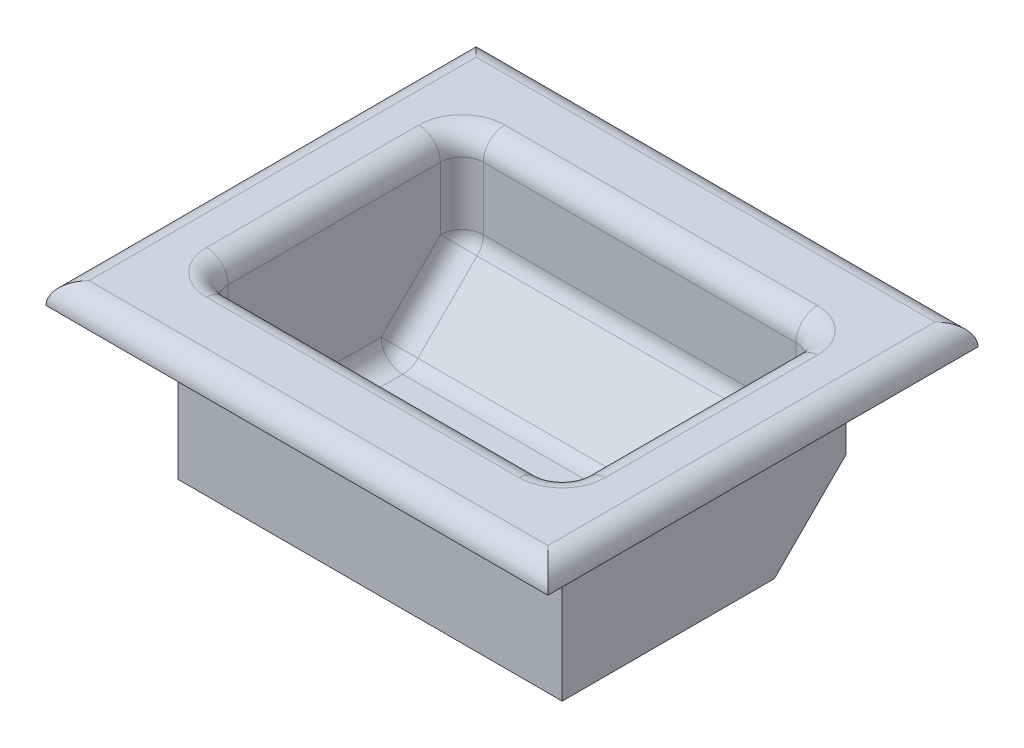
ISO-10303-21;
HEADER;
FILE_DESCRIPTION(('STEP AP214'),'2;1');
FILE_NAME('part.step','',(''),(''),'','','');
FILE_SCHEMA(('AUTOMOTIVE_DESIGN { 1 0 10303 214 1 1 1 1 }'));
ENDSEC;
DATA;
#1=APPLICATION_CONTEXT('core data for automotive mechanical design processes');
#2=APPLICATION_PROTOCOL_DEFINITION('international standard','automotive_design',2000,#1);
#3=PRODUCT_CONTEXT('',#1,'mechanical');
#4=PRODUCT('Part','Part','',(#3));
#5=PRODUCT_RELATED_PRODUCT_CATEGORY('part','',(#4));
#6=PRODUCT_DEFINITION_FORMATION('','',#4);
#7=PRODUCT_DEFINITION_CONTEXT('part definition',#1,'design');
#8=PRODUCT_DEFINITION('design','',#6,#7);
#9=PRODUCT_DEFINITION_SHAPE('','',#8);
#10=(LENGTH_UNIT() NAMED_UNIT(*) SI_UNIT(.MILLI.,.METRE.));
#11=(NAMED_UNIT(*) PLANE_ANGLE_UNIT() SI_UNIT($,.RADIAN.));
#12=(NAMED_UNIT(*) SI_UNIT($,.STERADIAN.) SOLID_ANGLE_UNIT());
#13=UNCERTAINTY_MEASURE_WITH_UNIT(LENGTH_MEASURE(1.E-05),#10,'distance_accuracy_value','');
#14=(GEOMETRIC_REPRESENTATION_CONTEXT(3) GLOBAL_UNCERTAINTY_ASSIGNED_CONTEXT((#13)) GLOBAL_UNIT_ASSIGNED_CONTEXT((#10,
#11,#12)) REPRESENTATION_CONTEXT('',''));
#15=CARTESIAN_POINT('',(0.,0.,0.));
#16=DIRECTION('',(0.,0.,1.));
#17=DIRECTION('',(1.,0.,0.));
#18=AXIS2_PLACEMENT_3D('',#15,#16,#17);
#19=CARTESIAN_POINT('',(-26.8,2.,19.8));
#20=DIRECTION('',(1.,0.,0.));
#21=DIRECTION('',(0.,0.,-1.));
#22=AXIS2_PLACEMENT_3D('',#19,#20,#21);
#23=PLANE('',#22);
#24=DIRECTION('',(0.,-1.,0.));
#25=VECTOR('',#24,1.);
#26=CARTESIAN_POINT('',(-26.8,2.,-19.8));
#27=LINE('',#26,#25);
#28=CARTESIAN_POINT('',(-26.8,22.,-19.8));
#29=VERTEX_POINT('',#28);
#30=CARTESIAN_POINT('',(-26.8,9.99999999999999,-19.8));
#31=VERTEX_POINT('',#30);
#32=EDGE_CURVE('E259',#29,#31,#27,.T.);
#33=ORIENTED_EDGE('',*,*,#32,.T.);
#34=DIRECTION('',(0.,0.707106781186546,-0.707106781186549));
#35=VECTOR('',#34,1.);
#36=CARTESIAN_POINT('',(-26.8,10.,-19.8));
#37=LINE('',#36,#35);
#38=CARTESIAN_POINT('',(-26.8,0.,-9.79999999999995));
#39=VERTEX_POINT('',#38);
#40=EDGE_CURVE('E274',#31,#39,#37,.F.);
#41=ORIENTED_EDGE('',*,*,#40,.T.);
#42=DIRECTION('',(0.,0.,1.));
#43=VECTOR('',#42,1.);
#44=CARTESIAN_POINT('',(-26.8,0.,19.8));
#45=LINE('',#44,#43);
#46=CARTESIAN_POINT('',(-26.8,0.,19.8));
#47=VERTEX_POINT('',#46);
#48=EDGE_CURVE('E252',#39,#47,#45,.T.);
#49=ORIENTED_EDGE('',*,*,#48,.T.);
#50=DIRECTION('',(0.,-1.,0.));
#51=VECTOR('',#50,1.);
#52=CARTESIAN_POINT('',(-26.8,2.,19.8));
#53=LINE('',#52,#51);
#54=CARTESIAN_POINT('',(-26.8,22.,19.8));
#55=VERTEX_POINT('',#54);
#56=EDGE_CURVE('E268',#55,#47,#53,.T.);
#57=ORIENTED_EDGE('',*,*,#56,.F.);
#58=DIRECTION('',(0.,0.,1.));
#59=VECTOR('',#58,1.);
#60=CARTESIAN_POINT('',(-26.8,22.,19.8));
#61=LINE('',#60,#59);
#62=EDGE_CURVE('E240',#29,#55,#61,.T.);
#63=ORIENTED_EDGE('',*,*,#62,.F.);
#64=EDGE_LOOP('',(#33,#41,#49,#57,#63));
#65=FACE_BOUND('',#64,.T.);
#66=ADVANCED_FACE('F34',(#65),#23,.F.);
#67=CARTESIAN_POINT('',(26.8,2.,19.8));
#68=DIRECTION('',(0.,0.,-1.));
#69=DIRECTION('',(-1.,0.,0.));
#70=AXIS2_PLACEMENT_3D('',#67,#68,#69);
#71=PLANE('',#70);
#72=DIRECTION('',(1.,0.,0.));
#73=VECTOR('',#72,1.);
#74=CARTESIAN_POINT('',(26.8,0.,19.8));
#75=LINE('',#74,#73);
#76=CARTESIAN_POINT('',(26.8,0.,19.8));
#77=VERTEX_POINT('',#76);
#78=EDGE_CURVE('E254',#47,#77,#75,.T.);
#79=ORIENTED_EDGE('',*,*,#78,.T.);
#80=DIRECTION('',(0.,-1.,0.));
#81=VECTOR('',#80,1.);
#82=CARTESIAN_POINT('',(26.8,2.,19.8));
#83=LINE('',#82,#81);
#84=CARTESIAN_POINT('',(26.8,22.,19.8));
#85=VERTEX_POINT('',#84);
#86=EDGE_CURVE('E265',#85,#77,#83,.T.);
#87=ORIENTED_EDGE('',*,*,#86,.F.);
#88=DIRECTION('',(1.,0.,0.));
#89=VECTOR('',#88,1.);
#90=CARTESIAN_POINT('',(26.8,22.,19.8));
#91=LINE('',#90,#89);
#92=EDGE_CURVE('E243',#55,#85,#91,.T.);
#93=ORIENTED_EDGE('',*,*,#92,.F.);
#94=ORIENTED_EDGE('',*,*,#56,.T.);
#95=EDGE_LOOP('',(#79,#87,#93,#94));
#96=FACE_BOUND('',#95,.T.);
#97=ADVANCED_FACE('F467',(#96),#71,.F.);
#98=CARTESIAN_POINT('',(26.8,2.,19.8));
#99=DIRECTION('',(-1.,0.,0.));
#100=DIRECTION('',(0.,0.,1.));
#101=AXIS2_PLACEMENT_3D('',#98,#99,#100);
#102=PLANE('',#101);
#103=DIRECTION('',(0.,0.,-1.));
#104=VECTOR('',#103,1.);
#105=CARTESIAN_POINT('',(26.8,0.,19.8));
#106=LINE('',#105,#104);
#107=CARTESIAN_POINT('',(26.8,0.,-9.79999999999995));
#108=VERTEX_POINT('',#107);
#109=EDGE_CURVE('E256',#77,#108,#106,.T.);
#110=ORIENTED_EDGE('',*,*,#109,.T.);
#111=DIRECTION('',(0.,-0.707106781186546,0.707106781186549));
#112=VECTOR('',#111,1.);
#113=CARTESIAN_POINT('',(26.8,9.99999999999999,-19.8));
#114=LINE('',#113,#112);
#115=CARTESIAN_POINT('',(26.8,9.99999999999999,-19.8));
#116=VERTEX_POINT('',#115);
#117=EDGE_CURVE('E278',#108,#116,#114,.F.);
#118=ORIENTED_EDGE('',*,*,#117,.T.);
#119=DIRECTION('',(0.,-1.,0.));
#120=VECTOR('',#119,1.);
#121=CARTESIAN_POINT('',(26.8,2.,-19.8));
#122=LINE('',#121,#120);
#123=CARTESIAN_POINT('',(26.8,22.,-19.8));
#124=VERTEX_POINT('',#123);
#125=EDGE_CURVE('E262',#124,#116,#122,.T.);
#126=ORIENTED_EDGE('',*,*,#125,.F.);
#127=DIRECTION('',(0.,0.,-1.));
#128=VECTOR('',#127,1.);
#129=CARTESIAN_POINT('',(26.8,22.,19.8));
#130=LINE('',#129,#128);
#131=EDGE_CURVE('E246',#85,#124,#130,.T.);
#132=ORIENTED_EDGE('',*,*,#131,.F.);
#133=ORIENTED_EDGE('',*,*,#86,.T.);
#134=EDGE_LOOP('',(#110,#118,#126,#132,#133));
#135=FACE_BOUND('',#134,.T.);
#136=ADVANCED_FACE('F473',(#135),#102,.F.);
#137=CARTESIAN_POINT('',(26.8,2.,-19.8));
#138=DIRECTION('',(0.,0.,1.));
#139=DIRECTION('',(1.,0.,0.));
#140=AXIS2_PLACEMENT_3D('',#137,#138,#139);
#141=PLANE('',#140);
#142=ORIENTED_EDGE('',*,*,#125,.T.);
#143=DIRECTION('',(-1.,0.,0.));
#144=VECTOR('',#143,1.);
#145=CARTESIAN_POINT('',(26.8,9.99999999999999,-19.8));
#146=LINE('',#145,#144);
#147=EDGE_CURVE('E271',#116,#31,#146,.T.);
#148=ORIENTED_EDGE('',*,*,#147,.T.);
#149=ORIENTED_EDGE('',*,*,#32,.F.);
#150=DIRECTION('',(-1.,0.,0.));
#151=VECTOR('',#150,1.);
#152=CARTESIAN_POINT('',(26.8,22.,-19.8));
#153=LINE('',#152,#151);
#154=EDGE_CURVE('E249',#124,#29,#153,.T.);
#155=ORIENTED_EDGE('',*,*,#154,.F.);
#156=EDGE_LOOP('',(#142,#148,#149,#155));
#157=FACE_BOUND('',#156,.T.);
#158=ADVANCED_FACE('F757',(#157),#141,.F.);
#159=CARTESIAN_POINT('',(0.,0.,0.));
#160=DIRECTION('',(0.,1.,0.));
#161=DIRECTION('',(0.,0.,1.));
#162=AXIS2_PLACEMENT_3D('',#159,#160,#161);
#163=PLANE('',#162);
#164=ORIENTED_EDGE('',*,*,#48,.F.);
#165=DIRECTION('',(1.,0.,0.));
#166=VECTOR('',#165,1.);
#167=CARTESIAN_POINT('',(0.,0.,-9.79999999999996));
#168=LINE('',#167,#166);
#169=EDGE_CURVE('E276',#39,#108,#168,.T.);
#170=ORIENTED_EDGE('',*,*,#169,.T.);
#171=ORIENTED_EDGE('',*,*,#109,.F.);
#172=ORIENTED_EDGE('',*,*,#78,.F.);
#173=EDGE_LOOP('',(#164,#170,#171,#172));
#174=FACE_BOUND('',#173,.T.);
#175=ADVANCED_FACE('F464',(#174),#163,.F.);
#176=CARTESIAN_POINT('',(0.,22.,0.));
#177=DIRECTION('',(0.,1.,0.));
#178=DIRECTION('',(0.,0.,1.));
#179=AXIS2_PLACEMENT_3D('',#176,#177,#178);
#180=PLANE('',#179);
#181=DIRECTION('',(0.,0.,1.));
#182=VECTOR('',#181,1.);
#183=CARTESIAN_POINT('',(-35.,22.,30.));
#184=LINE('',#183,#182);
#185=CARTESIAN_POINT('',(-35.,22.,-30.));
#186=VERTEX_POINT('',#185);
#187=CARTESIAN_POINT('',(-35.,22.,30.));
#188=VERTEX_POINT('',#187);
#189=EDGE_CURVE('E224',#186,#188,#184,.T.);
#190=ORIENTED_EDGE('',*,*,#189,.F.);
#191=DIRECTION('',(-1.,0.,0.));
#192=VECTOR('',#191,1.);
#193=CARTESIAN_POINT('',(35.,22.,-30.));
#194=LINE('',#193,#192);
#195=CARTESIAN_POINT('',(35.,22.,-30.));
#196=VERTEX_POINT('',#195);
#197=EDGE_CURVE('E236',#196,#186,#194,.T.);
#198=ORIENTED_EDGE('',*,*,#197,.F.);
#199=DIRECTION('',(0.,0.,-1.));
#200=VECTOR('',#199,1.);
#201=CARTESIAN_POINT('',(35.,22.,30.));
#202=LINE('',#201,#200);
#203=CARTESIAN_POINT('',(35.,22.,30.));
#204=VERTEX_POINT('',#203);
#205=EDGE_CURVE('E234',#204,#196,#202,.T.);
#206=ORIENTED_EDGE('',*,*,#205,.F.);
#207=DIRECTION('',(1.,0.,0.));
#208=VECTOR('',#207,1.);
#209=CARTESIAN_POINT('',(35.,22.,30.));
#210=LINE('',#209,#208);
#211=EDGE_CURVE('E214',#188,#204,#210,.T.);
#212=ORIENTED_EDGE('',*,*,#211,.F.);
#213=EDGE_LOOP('',(#190,#198,#206,#212));
#214=FACE_BOUND('',#213,.T.);
#215=ORIENTED_EDGE('',*,*,#154,.T.);
#216=ORIENTED_EDGE('',*,*,#62,.T.);
#217=ORIENTED_EDGE('',*,*,#92,.T.);
#218=ORIENTED_EDGE('',*,*,#131,.T.);
#219=EDGE_LOOP('',(#215,#216,#217,#218));
#220=FACE_BOUND('',#219,.T.);
#221=ADVANCED_FACE('F231',(#214,#220),#180,.F.);
#222=CARTESIAN_POINT('',(0.,25.,0.));
#223=DIRECTION('',(0.,1.,0.));
#224=DIRECTION('',(0.,0.,1.));
#225=AXIS2_PLACEMENT_3D('',#222,#223,#224);
#226=PLANE('',#225);
#227=CARTESIAN_POINT('',(21.8,25.,-14.8));
#228=DIRECTION('',(0.,1.,0.));
#229=DIRECTION('',(0.,0.,1.));
#230=AXIS2_PLACEMENT_3D('',#227,#228,#229);
#231=CIRCLE('',#230,6.);
#232=CARTESIAN_POINT('',(27.8,25.,-14.8));
#233=VERTEX_POINT('',#232);
#234=CARTESIAN_POINT('',(21.8,25.,-20.8));
#235=VERTEX_POINT('',#234);
#236=EDGE_CURVE('E320',#233,#235,#231,.T.);
#237=ORIENTED_EDGE('',*,*,#236,.F.);
#238=DIRECTION('',(0.,0.,-1.));
#239=VECTOR('',#238,1.);
#240=CARTESIAN_POINT('',(27.8,25.,0.));
#241=LINE('',#240,#239);
#242=CARTESIAN_POINT('',(27.8,25.,14.8));
#243=VERTEX_POINT('',#242);
#244=EDGE_CURVE('E326',#233,#243,#241,.F.);
#245=ORIENTED_EDGE('',*,*,#244,.T.);
#246=CARTESIAN_POINT('',(21.8,25.,14.8));
#247=DIRECTION('',(0.,1.,0.));
#248=DIRECTION('',(0.,0.,1.));
#249=AXIS2_PLACEMENT_3D('',#246,#247,#248);
#250=CIRCLE('',#249,6.);
#251=CARTESIAN_POINT('',(21.8,25.,20.8));
#252=VERTEX_POINT('',#251);
#253=EDGE_CURVE('E323',#252,#243,#250,.T.);
#254=ORIENTED_EDGE('',*,*,#253,.F.);
#255=DIRECTION('',(1.,0.,0.));
#256=VECTOR('',#255,1.);
#257=CARTESIAN_POINT('',(0.,25.,20.8));
#258=LINE('',#257,#256);
#259=CARTESIAN_POINT('',(-21.8,25.,20.8));
#260=VERTEX_POINT('',#259);
#261=EDGE_CURVE('E317',#252,#260,#258,.F.);
#262=ORIENTED_EDGE('',*,*,#261,.T.);
#263=CARTESIAN_POINT('',(-21.8,25.,14.8));
#264=DIRECTION('',(0.,1.,0.));
#265=DIRECTION('',(0.,0.,1.));
#266=AXIS2_PLACEMENT_3D('',#263,#264,#265);
#267=CIRCLE('',#266,6.);
#268=CARTESIAN_POINT('',(-27.8,25.,14.8));
#269=VERTEX_POINT('',#268);
#270=EDGE_CURVE('E314',#269,#260,#267,.T.);
#271=ORIENTED_EDGE('',*,*,#270,.F.);
#272=DIRECTION('',(0.,0.,1.));
#273=VECTOR('',#272,1.);
#274=CARTESIAN_POINT('',(-27.8,25.,0.));
#275=LINE('',#274,#273);
#276=CARTESIAN_POINT('',(-27.8,25.,-14.8));
#277=VERTEX_POINT('',#276);
#278=EDGE_CURVE('E310',#269,#277,#275,.F.);
#279=ORIENTED_EDGE('',*,*,#278,.T.);
#280=CARTESIAN_POINT('',(-21.8,25.,-14.8));
#281=DIRECTION('',(0.,1.,0.));
#282=DIRECTION('',(0.,0.,1.));
#283=AXIS2_PLACEMENT_3D('',#280,#281,#282);
#284=CIRCLE('',#283,6.);
#285=CARTESIAN_POINT('',(-21.8,25.,-20.8));
#286=VERTEX_POINT('',#285);
#287=EDGE_CURVE('E307',#286,#277,#284,.T.);
#288=ORIENTED_EDGE('',*,*,#287,.F.);
#289=DIRECTION('',(-1.,0.,0.));
#290=VECTOR('',#289,1.);
#291=CARTESIAN_POINT('',(0.,25.,-20.8));
#292=LINE('',#291,#290);
#293=EDGE_CURVE('E312',#286,#235,#292,.F.);
#294=ORIENTED_EDGE('',*,*,#293,.T.);
#295=EDGE_LOOP('',(#237,#245,#254,#262,#271,#279,#288,#294));
#296=FACE_BOUND('',#295,.T.);
#297=DIRECTION('',(1.,0.,0.));
#298=VECTOR('',#297,1.);
#299=CARTESIAN_POINT('',(35.,25.,27.));
#300=LINE('',#299,#298);
#301=CARTESIAN_POINT('',(-32.,25.,27.));
#302=VERTEX_POINT('',#301);
#303=CARTESIAN_POINT('',(32.,25.,27.));
#304=VERTEX_POINT('',#303);
#305=EDGE_CURVE('E217',#302,#304,#300,.T.);
#306=ORIENTED_EDGE('',*,*,#305,.T.);
#307=DIRECTION('',(0.,0.,-1.));
#308=VECTOR('',#307,1.);
#309=CARTESIAN_POINT('',(32.,25.,-30.));
#310=LINE('',#309,#308);
#311=CARTESIAN_POINT('',(32.,25.,-27.));
#312=VERTEX_POINT('',#311);
#313=EDGE_CURVE('E305',#304,#312,#310,.T.);
#314=ORIENTED_EDGE('',*,*,#313,.T.);
#315=DIRECTION('',(-1.,0.,0.));
#316=VECTOR('',#315,1.);
#317=CARTESIAN_POINT('',(-35.,25.,-27.));
#318=LINE('',#317,#316);
#319=CARTESIAN_POINT('',(-32.,25.,-27.));
#320=VERTEX_POINT('',#319);
#321=EDGE_CURVE('E302',#312,#320,#318,.T.);
#322=ORIENTED_EDGE('',*,*,#321,.T.);
#323=DIRECTION('',(0.,0.,1.));
#324=VECTOR('',#323,1.);
#325=CARTESIAN_POINT('',(-32.,25.,30.));
#326=LINE('',#325,#324);
#327=EDGE_CURVE('E300',#320,#302,#326,.T.);
#328=ORIENTED_EDGE('',*,*,#327,.T.);
#329=EDGE_LOOP('',(#306,#314,#322,#328));
#330=FACE_BOUND('',#329,.T.);
#331=ADVANCED_FACE('F452',(#296,#330),#226,.T.);
#332=CARTESIAN_POINT('',(0.,2.,0.));
#333=DIRECTION('',(0.,1.,0.));
#334=DIRECTION('',(0.,0.,1.));
#335=AXIS2_PLACEMENT_3D('',#332,#333,#334);
#336=PLANE('',#335);
#337=DIRECTION('',(1.,0.,0.));
#338=VECTOR('',#337,1.);
#339=CARTESIAN_POINT('',(0.,2.,-6.55735931288065));
#340=LINE('',#339,#338);
#341=CARTESIAN_POINT('',(21.8,2.,-6.55735931288065));
#342=VERTEX_POINT('',#341);
#343=CARTESIAN_POINT('',(-21.8,2.,-6.55735931288065));
#344=VERTEX_POINT('',#343);
#345=EDGE_CURVE('E341',#342,#344,#340,.F.);
#346=ORIENTED_EDGE('',*,*,#345,.T.);
#347=DIRECTION('',(0.,0.,1.));
#348=VECTOR('',#347,1.);
#349=CARTESIAN_POINT('',(-21.8,2.,17.8));
#350=LINE('',#349,#348);
#351=CARTESIAN_POINT('',(-21.8,2.,14.8));
#352=VERTEX_POINT('',#351);
#353=EDGE_CURVE('E346',#344,#352,#350,.T.);
#354=ORIENTED_EDGE('',*,*,#353,.T.);
#355=DIRECTION('',(1.,0.,0.));
#356=VECTOR('',#355,1.);
#357=CARTESIAN_POINT('',(24.8,2.,14.8));
#358=LINE('',#357,#356);
#359=CARTESIAN_POINT('',(21.8,2.,14.8));
#360=VERTEX_POINT('',#359);
#361=EDGE_CURVE('E343',#352,#360,#358,.T.);
#362=ORIENTED_EDGE('',*,*,#361,.T.);
#363=DIRECTION('',(0.,0.,-1.));
#364=VECTOR('',#363,1.);
#365=CARTESIAN_POINT('',(21.8,2.,-7.79999999999993));
#366=LINE('',#365,#364);
#367=EDGE_CURVE('E339',#360,#342,#366,.T.);
#368=ORIENTED_EDGE('',*,*,#367,.T.);
#369=EDGE_LOOP('',(#346,#354,#362,#368));
#370=FACE_BOUND('',#369,.T.);
#371=ADVANCED_FACE('F454',(#370),#336,.T.);
#372=CARTESIAN_POINT('',(24.8,22.,-17.8));
#373=DIRECTION('',(0.,0.,1.));
#374=DIRECTION('',(1.,0.,0.));
#375=AXIS2_PLACEMENT_3D('',#372,#373,#374);
#376=PLANE('',#375);
#377=DIRECTION('',(-1.,0.,0.));
#378=VECTOR('',#377,1.);
#379=CARTESIAN_POINT('',(24.8,22.,-17.8));
#380=LINE('',#379,#378);
#381=CARTESIAN_POINT('',(21.8,22.,-17.8));
#382=VERTEX_POINT('',#381);
#383=CARTESIAN_POINT('',(-21.8,22.,-17.8));
#384=VERTEX_POINT('',#383);
#385=EDGE_CURVE('E348',#382,#384,#380,.T.);
#386=ORIENTED_EDGE('',*,*,#385,.T.);
#387=DIRECTION('',(0.,-1.,0.));
#388=VECTOR('',#387,1.);
#389=CARTESIAN_POINT('',(-21.8,12.,-17.8));
#390=LINE('',#389,#388);
#391=CARTESIAN_POINT('',(-21.8,13.2426406871193,-17.8));
#392=VERTEX_POINT('',#391);
#393=EDGE_CURVE('E354',#384,#392,#390,.T.);
#394=ORIENTED_EDGE('',*,*,#393,.T.);
#395=DIRECTION('',(-1.,0.,0.));
#396=VECTOR('',#395,1.);
#397=CARTESIAN_POINT('',(24.8,13.2426406871193,-17.8));
#398=LINE('',#397,#396);
#399=CARTESIAN_POINT('',(21.8,13.2426406871193,-17.8));
#400=VERTEX_POINT('',#399);
#401=EDGE_CURVE('E352',#392,#400,#398,.F.);
#402=ORIENTED_EDGE('',*,*,#401,.T.);
#403=DIRECTION('',(0.,-1.,0.));
#404=VECTOR('',#403,1.);
#405=CARTESIAN_POINT('',(21.8,25.,-17.8));
#406=LINE('',#405,#404);
#407=EDGE_CURVE('E350',#400,#382,#406,.F.);
#408=ORIENTED_EDGE('',*,*,#407,.T.);
#409=EDGE_LOOP('',(#386,#394,#402,#408));
#410=FACE_BOUND('',#409,.T.);
#411=ADVANCED_FACE('F461',(#410),#376,.T.);
#412=CARTESIAN_POINT('',(24.8,22.,17.8));
#413=DIRECTION('',(-1.,0.,0.));
#414=DIRECTION('',(0.,0.,1.));
#415=AXIS2_PLACEMENT_3D('',#412,#413,#414);
#416=PLANE('',#415);
#417=DIRECTION('',(0.,-1.,0.));
#418=VECTOR('',#417,1.);
#419=CARTESIAN_POINT('',(24.8,12.,-14.8));
#420=LINE('',#419,#418);
#421=CARTESIAN_POINT('',(24.8,22.,-14.8));
#422=VERTEX_POINT('',#421);
#423=CARTESIAN_POINT('',(24.8,13.2426406871193,-14.8));
#424=VERTEX_POINT('',#423);
#425=EDGE_CURVE('E291',#422,#424,#420,.T.);
#426=ORIENTED_EDGE('',*,*,#425,.T.);
#427=DIRECTION('',(0.,0.707106781186544,-0.707106781186551));
#428=VECTOR('',#427,1.);
#429=CARTESIAN_POINT('',(24.8,1.32132034355959,-2.87867965644021));
#430=LINE('',#429,#428);
#431=CARTESIAN_POINT('',(24.8,5.,-6.55735931288065));
#432=VERTEX_POINT('',#431);
#433=EDGE_CURVE('E298',#424,#432,#430,.F.);
#434=ORIENTED_EDGE('',*,*,#433,.T.);
#435=DIRECTION('',(0.,0.,-1.));
#436=VECTOR('',#435,1.);
#437=CARTESIAN_POINT('',(24.8,5.,17.8));
#438=LINE('',#437,#436);
#439=CARTESIAN_POINT('',(24.8,5.,14.8));
#440=VERTEX_POINT('',#439);
#441=EDGE_CURVE('E296',#432,#440,#438,.F.);
#442=ORIENTED_EDGE('',*,*,#441,.T.);
#443=DIRECTION('',(0.,-1.,0.));
#444=VECTOR('',#443,1.);
#445=CARTESIAN_POINT('',(24.8,25.,14.8));
#446=LINE('',#445,#444);
#447=CARTESIAN_POINT('',(24.8,22.,14.8));
#448=VERTEX_POINT('',#447);
#449=EDGE_CURVE('E293',#440,#448,#446,.F.);
#450=ORIENTED_EDGE('',*,*,#449,.T.);
#451=DIRECTION('',(0.,0.,-1.));
#452=VECTOR('',#451,1.);
#453=CARTESIAN_POINT('',(24.8,22.,17.8));
#454=LINE('',#453,#452);
#455=EDGE_CURVE('E289',#448,#422,#454,.T.);
#456=ORIENTED_EDGE('',*,*,#455,.T.);
#457=EDGE_LOOP('',(#426,#434,#442,#450,#456));
#458=FACE_BOUND('',#457,.T.);
#459=ADVANCED_FACE('F718',(#458),#416,.T.);
#460=CARTESIAN_POINT('',(24.8,22.,17.8));
#461=DIRECTION('',(0.,0.,-1.));
#462=DIRECTION('',(-1.,0.,0.));
#463=AXIS2_PLACEMENT_3D('',#460,#461,#462);
#464=PLANE('',#463);
#465=DIRECTION('',(1.,0.,0.));
#466=VECTOR('',#465,1.);
#467=CARTESIAN_POINT('',(24.8,22.,17.8));
#468=LINE('',#467,#466);
#469=CARTESIAN_POINT('',(-21.8,22.,17.8));
#470=VERTEX_POINT('',#469);
#471=CARTESIAN_POINT('',(21.8,22.,17.8));
#472=VERTEX_POINT('',#471);
#473=EDGE_CURVE('E284',#470,#472,#468,.T.);
#474=ORIENTED_EDGE('',*,*,#473,.T.);
#475=DIRECTION('',(0.,-1.,0.));
#476=VECTOR('',#475,1.);
#477=CARTESIAN_POINT('',(21.8,2.,17.8));
#478=LINE('',#477,#476);
#479=CARTESIAN_POINT('',(21.8,5.,17.8));
#480=VERTEX_POINT('',#479);
#481=EDGE_CURVE('E286',#472,#480,#478,.T.);
#482=ORIENTED_EDGE('',*,*,#481,.T.);
#483=DIRECTION('',(1.,0.,0.));
#484=VECTOR('',#483,1.);
#485=CARTESIAN_POINT('',(-24.8,5.,17.8));
#486=LINE('',#485,#484);
#487=CARTESIAN_POINT('',(-21.8,5.,17.8));
#488=VERTEX_POINT('',#487);
#489=EDGE_CURVE('E280',#480,#488,#486,.F.);
#490=ORIENTED_EDGE('',*,*,#489,.T.);
#491=DIRECTION('',(0.,-1.,0.));
#492=VECTOR('',#491,1.);
#493=CARTESIAN_POINT('',(-21.8,25.,17.8));
#494=LINE('',#493,#492);
#495=EDGE_CURVE('E282',#488,#470,#494,.F.);
#496=ORIENTED_EDGE('',*,*,#495,.T.);
#497=EDGE_LOOP('',(#474,#482,#490,#496));
#498=FACE_BOUND('',#497,.T.);
#499=ADVANCED_FACE('F710',(#498),#464,.T.);
#500=CARTESIAN_POINT('',(-24.8,22.,17.8));
#501=DIRECTION('',(1.,0.,0.));
#502=DIRECTION('',(0.,0.,-1.));
#503=AXIS2_PLACEMENT_3D('',#500,#501,#502);
#504=PLANE('',#503);
#505=DIRECTION('',(0.,0.,1.));
#506=VECTOR('',#505,1.);
#507=CARTESIAN_POINT('',(-24.8,5.,-7.79999999999993));
#508=LINE('',#507,#506);
#509=CARTESIAN_POINT('',(-24.8,5.,14.8));
#510=VERTEX_POINT('',#509);
#511=CARTESIAN_POINT('',(-24.8,5.,-6.55735931288065));
#512=VERTEX_POINT('',#511);
#513=EDGE_CURVE('E335',#510,#512,#508,.F.);
#514=ORIENTED_EDGE('',*,*,#513,.T.);
#515=DIRECTION('',(0.,-0.707106781186544,0.707106781186551));
#516=VECTOR('',#515,1.);
#517=CARTESIAN_POINT('',(-24.8,1.32132034355959,-2.87867965644022));
#518=LINE('',#517,#516);
#519=CARTESIAN_POINT('',(-24.8,13.2426406871193,-14.8));
#520=VERTEX_POINT('',#519);
#521=EDGE_CURVE('E337',#512,#520,#518,.F.);
#522=ORIENTED_EDGE('',*,*,#521,.T.);
#523=DIRECTION('',(0.,-1.,0.));
#524=VECTOR('',#523,1.);
#525=CARTESIAN_POINT('',(-24.8,25.,-14.8));
#526=LINE('',#525,#524);
#527=CARTESIAN_POINT('',(-24.8,22.,-14.8));
#528=VERTEX_POINT('',#527);
#529=EDGE_CURVE('E330',#520,#528,#526,.F.);
#530=ORIENTED_EDGE('',*,*,#529,.T.);
#531=DIRECTION('',(0.,0.,1.));
#532=VECTOR('',#531,1.);
#533=CARTESIAN_POINT('',(-24.8,22.,17.8));
#534=LINE('',#533,#532);
#535=CARTESIAN_POINT('',(-24.8,22.,14.8));
#536=VERTEX_POINT('',#535);
#537=EDGE_CURVE('E328',#528,#536,#534,.T.);
#538=ORIENTED_EDGE('',*,*,#537,.T.);
#539=DIRECTION('',(0.,-1.,0.));
#540=VECTOR('',#539,1.);
#541=CARTESIAN_POINT('',(-24.8,2.,14.8));
#542=LINE('',#541,#540);
#543=EDGE_CURVE('E332',#536,#510,#542,.T.);
#544=ORIENTED_EDGE('',*,*,#543,.T.);
#545=EDGE_LOOP('',(#514,#522,#530,#538,#544));
#546=FACE_BOUND('',#545,.T.);
#547=ADVANCED_FACE('F482',(#546),#504,.T.);
#548=CARTESIAN_POINT('',(0.,2.,-7.79999999999993));
#549=DIRECTION('',(0.,0.707106781186551,0.707106781186544));
#550=DIRECTION('',(1.,0.,0.));
#551=AXIS2_PLACEMENT_3D('',#548,#549,#550);
#552=PLANE('',#551);
#553=DIRECTION('',(0.,-0.707106781186544,0.707106781186551));
#554=VECTOR('',#553,1.);
#555=CARTESIAN_POINT('',(21.8,2.,-7.79999999999993));
#556=LINE('',#555,#554);
#557=CARTESIAN_POINT('',(21.8,2.87867965644035,-8.67867965644028));
#558=VERTEX_POINT('',#557);
#559=CARTESIAN_POINT('',(21.8,11.1213203435596,-16.9213203435596));
#560=VERTEX_POINT('',#559);
#561=EDGE_CURVE('E43',#558,#560,#556,.F.);
#562=ORIENTED_EDGE('',*,*,#561,.T.);
#563=DIRECTION('',(1.,0.,0.));
#564=VECTOR('',#563,1.);
#565=CARTESIAN_POINT('',(0.,11.1213203435596,-16.9213203435596));
#566=LINE('',#565,#564);
#567=CARTESIAN_POINT('',(-21.8,11.1213203435596,-16.9213203435596));
#568=VERTEX_POINT('',#567);
#569=EDGE_CURVE('E11',#560,#568,#566,.F.);
#570=ORIENTED_EDGE('',*,*,#569,.T.);
#571=DIRECTION('',(0.,0.707106781186544,-0.707106781186551));
#572=VECTOR('',#571,1.);
#573=CARTESIAN_POINT('',(-21.8,2.,-7.79999999999993));
#574=LINE('',#573,#572);
#575=CARTESIAN_POINT('',(-21.8,2.87867965644035,-8.67867965644028));
#576=VERTEX_POINT('',#575);
#577=EDGE_CURVE('E57',#568,#576,#574,.F.);
#578=ORIENTED_EDGE('',*,*,#577,.T.);
#579=DIRECTION('',(-1.,0.,0.));
#580=VECTOR('',#579,1.);
#581=CARTESIAN_POINT('',(0.,2.87867965644035,-8.67867965644028));
#582=LINE('',#581,#580);
#583=EDGE_CURVE('E357',#576,#558,#582,.F.);
#584=ORIENTED_EDGE('',*,*,#583,.T.);
#585=EDGE_LOOP('',(#562,#570,#578,#584));
#586=FACE_BOUND('',#585,.T.);
#587=ADVANCED_FACE('F478',(#586),#552,.T.);
#588=CARTESIAN_POINT('',(26.8,9.99999999999999,-19.8));
#589=DIRECTION('',(0.,0.707106781186549,0.707106781186546));
#590=DIRECTION('',(-1.,0.,0.));
#591=AXIS2_PLACEMENT_3D('',#588,#589,#590);
#592=PLANE('',#591);
#593=ORIENTED_EDGE('',*,*,#117,.F.);
#594=ORIENTED_EDGE('',*,*,#169,.F.);
#595=ORIENTED_EDGE('',*,*,#40,.F.);
#596=ORIENTED_EDGE('',*,*,#147,.F.);
#597=EDGE_LOOP('',(#593,#594,#595,#596));
#598=FACE_BOUND('',#597,.T.);
#599=ADVANCED_FACE('F481',(#598),#592,.F.);
#600=CARTESIAN_POINT('',(-21.8,13.2426406871193,-14.8));
#601=DIRECTION('',(0.,0.,1.));
#602=DIRECTION('',(1.,0.,0.));
#603=AXIS2_PLACEMENT_3D('',#600,#601,#602);
#604=SPHERICAL_SURFACE('',#603,3.);
#605=CARTESIAN_POINT('',(-21.8,13.2426406871193,-14.8));
#606=DIRECTION('',(1.,0.,0.));
#607=DIRECTION('',(0.,0.,-1.));
#608=AXIS2_PLACEMENT_3D('',#605,#606,#607);
#609=CIRCLE('',#608,3.);
#610=EDGE_CURVE('E437',#392,#568,#609,.F.);
#611=ORIENTED_EDGE('',*,*,#610,.F.);
#612=CARTESIAN_POINT('',(-21.8,13.2426406871193,-14.8));
#613=DIRECTION('',(0.,1.,0.));
#614=DIRECTION('',(-1.,0.,0.));
#615=AXIS2_PLACEMENT_3D('',#612,#613,#614);
#616=CIRCLE('',#615,3.);
#617=EDGE_CURVE('E229',#520,#392,#616,.F.);
#618=ORIENTED_EDGE('',*,*,#617,.F.);
#619=CARTESIAN_POINT('',(-21.8,13.2426406871193,-14.8));
#620=DIRECTION('',(0.,-0.707106781186545,0.70710678118655));
#621=DIRECTION('',(0.,-0.70710678118655,-0.707106781186545));
#622=AXIS2_PLACEMENT_3D('',#619,#620,#621);
#623=CIRCLE('',#622,3.);
#624=EDGE_CURVE('E440',#568,#520,#623,.F.);
#625=ORIENTED_EDGE('',*,*,#624,.F.);
#626=EDGE_LOOP('',(#611,#618,#625));
#627=FACE_BOUND('',#626,.T.);
#628=ADVANCED_FACE('F485',(#627),#604,.F.);
#629=CARTESIAN_POINT('',(-21.8,22.,-14.8));
#630=DIRECTION('',(0.,1.,0.));
#631=DIRECTION('',(0.,0.,1.));
#632=AXIS2_PLACEMENT_3D('',#629,#630,#631);
#633=CYLINDRICAL_SURFACE('',#632,3.);
#634=ORIENTED_EDGE('',*,*,#617,.T.);
#635=ORIENTED_EDGE('',*,*,#393,.F.);
#636=CARTESIAN_POINT('',(-21.8,22.,-14.8));
#637=DIRECTION('',(0.,1.,0.));
#638=DIRECTION('',(0.,0.,1.));
#639=AXIS2_PLACEMENT_3D('',#636,#637,#638);
#640=CIRCLE('',#639,3.);
#641=EDGE_CURVE('E434',#528,#384,#640,.F.);
#642=ORIENTED_EDGE('',*,*,#641,.F.);
#643=ORIENTED_EDGE('',*,*,#529,.F.);
#644=EDGE_LOOP('',(#634,#635,#642,#643));
#645=FACE_BOUND('',#644,.T.);
#646=ADVANCED_FACE('F578',(#645),#633,.F.);
#647=CARTESIAN_POINT('',(-21.8,1.32132034355959,-2.87867965644021));
#648=DIRECTION('',(0.,-0.707106781186544,0.707106781186551));
#649=DIRECTION('',(0.,-0.707106781186551,-0.707106781186544));
#650=AXIS2_PLACEMENT_3D('',#647,#648,#649);
#651=CYLINDRICAL_SURFACE('',#650,3.);
#652=ORIENTED_EDGE('',*,*,#624,.T.);
#653=ORIENTED_EDGE('',*,*,#521,.F.);
#654=CARTESIAN_POINT('',(-21.8,5.,-6.55735931288065));
#655=DIRECTION('',(0.,0.707106781186544,-0.707106781186551));
#656=DIRECTION('',(0.,0.707106781186551,0.707106781186544));
#657=AXIS2_PLACEMENT_3D('',#654,#655,#656);
#658=CIRCLE('',#657,3.);
#659=EDGE_CURVE('E431',#576,#512,#658,.T.);
#660=ORIENTED_EDGE('',*,*,#659,.F.);
#661=ORIENTED_EDGE('',*,*,#577,.F.);
#662=EDGE_LOOP('',(#652,#653,#660,#661));
#663=FACE_BOUND('',#662,.T.);
#664=ADVANCED_FACE('F574',(#663),#651,.F.);
#665=CARTESIAN_POINT('',(24.8,13.2426406871193,-14.8));
#666=DIRECTION('',(-1.,0.,0.));
#667=DIRECTION('',(0.,0.,1.));
#668=AXIS2_PLACEMENT_3D('',#665,#666,#667);
#669=CYLINDRICAL_SURFACE('',#668,3.);
#670=ORIENTED_EDGE('',*,*,#610,.T.);
#671=ORIENTED_EDGE('',*,*,#569,.F.);
#672=CARTESIAN_POINT('',(21.8,13.2426406871193,-14.8));
#673=DIRECTION('',(-1.,0.,0.));
#674=DIRECTION('',(0.,0.,1.));
#675=AXIS2_PLACEMENT_3D('',#672,#673,#674);
#676=CIRCLE('',#675,3.);
#677=EDGE_CURVE('E428',#400,#560,#676,.T.);
#678=ORIENTED_EDGE('',*,*,#677,.F.);
#679=ORIENTED_EDGE('',*,*,#401,.F.);
#680=EDGE_LOOP('',(#670,#671,#678,#679));
#681=FACE_BOUND('',#680,.T.);
#682=ADVANCED_FACE('F570',(#681),#669,.F.);
#683=CARTESIAN_POINT('',(-21.8,22.,-14.8));
#684=DIRECTION('',(0.,1.,0.));
#685=DIRECTION('',(0.,0.,1.));
#686=AXIS2_PLACEMENT_3D('',#683,#684,#685);
#687=TOROIDAL_SURFACE('',#686,6.,3.);
#688=CARTESIAN_POINT('',(-27.8,22.,-14.8));
#689=DIRECTION('',(0.,0.,-1.));
#690=DIRECTION('',(-1.,0.,0.));
#691=AXIS2_PLACEMENT_3D('',#688,#689,#690);
#692=CIRCLE('',#691,3.);
#693=EDGE_CURVE('E419',#528,#277,#692,.F.);
#694=ORIENTED_EDGE('',*,*,#693,.F.);
#695=ORIENTED_EDGE('',*,*,#641,.T.);
#696=CARTESIAN_POINT('',(-21.8,22.,-20.8));
#697=DIRECTION('',(-1.,0.,0.));
#698=DIRECTION('',(0.,0.,1.));
#699=AXIS2_PLACEMENT_3D('',#696,#697,#698);
#700=CIRCLE('',#699,3.);
#701=EDGE_CURVE('E422',#286,#384,#700,.F.);
#702=ORIENTED_EDGE('',*,*,#701,.F.);
#703=ORIENTED_EDGE('',*,*,#287,.T.);
#704=EDGE_LOOP('',(#694,#695,#702,#703));
#705=FACE_BOUND('',#704,.T.);
#706=ADVANCED_FACE('F566',(#705),#687,.T.);
#707=CARTESIAN_POINT('',(-21.8,5.,-6.55735931288065));
#708=DIRECTION('',(0.,0.,1.));
#709=DIRECTION('',(1.,0.,0.));
#710=AXIS2_PLACEMENT_3D('',#707,#708,#709);
#711=SPHERICAL_SURFACE('',#710,3.);
#712=CARTESIAN_POINT('',(-21.8,5.,-6.55735931288065));
#713=DIRECTION('',(1.,0.,0.));
#714=DIRECTION('',(0.,0.,-1.));
#715=AXIS2_PLACEMENT_3D('',#712,#713,#714);
#716=CIRCLE('',#715,3.);
#717=EDGE_CURVE('E413',#576,#344,#716,.F.);
#718=ORIENTED_EDGE('',*,*,#717,.F.);
#719=ORIENTED_EDGE('',*,*,#659,.T.);
#720=CARTESIAN_POINT('',(-21.8,5.,-6.55735931288065));
#721=DIRECTION('',(0.,0.,1.));
#722=DIRECTION('',(0.,-1.,0.));
#723=AXIS2_PLACEMENT_3D('',#720,#721,#722);
#724=CIRCLE('',#723,3.);
#725=EDGE_CURVE('E416',#344,#512,#724,.F.);
#726=ORIENTED_EDGE('',*,*,#725,.F.);
#727=EDGE_LOOP('',(#718,#719,#726));
#728=FACE_BOUND('',#727,.T.);
#729=ADVANCED_FACE('F562',(#728),#711,.F.);
#730=CARTESIAN_POINT('',(21.8,13.2426406871193,-14.8));
#731=DIRECTION('',(0.,0.,1.));
#732=DIRECTION('',(1.,0.,0.));
#733=AXIS2_PLACEMENT_3D('',#730,#731,#732);
#734=SPHERICAL_SURFACE('',#733,3.);
#735=CARTESIAN_POINT('',(21.8,13.2426406871193,-14.8));
#736=DIRECTION('',(0.,-0.707106781186544,0.707106781186551));
#737=DIRECTION('',(0.,-0.707106781186551,-0.707106781186544));
#738=AXIS2_PLACEMENT_3D('',#735,#736,#737);
#739=CIRCLE('',#738,3.);
#740=EDGE_CURVE('E410',#424,#560,#739,.F.);
#741=ORIENTED_EDGE('',*,*,#740,.F.);
#742=CARTESIAN_POINT('',(21.8,13.2426406871193,-14.8));
#743=DIRECTION('',(0.,1.,0.));
#744=DIRECTION('',(0.,0.,1.));
#745=AXIS2_PLACEMENT_3D('',#742,#743,#744);
#746=CIRCLE('',#745,3.);
#747=EDGE_CURVE('E425',#400,#424,#746,.F.);
#748=ORIENTED_EDGE('',*,*,#747,.F.);
#749=ORIENTED_EDGE('',*,*,#677,.T.);
#750=EDGE_LOOP('',(#741,#748,#749));
#751=FACE_BOUND('',#750,.T.);
#752=ADVANCED_FACE('F558',(#751),#734,.F.);
#753=CARTESIAN_POINT('',(21.8,22.,-14.8));
#754=DIRECTION('',(0.,1.,0.));
#755=DIRECTION('',(0.,0.,1.));
#756=AXIS2_PLACEMENT_3D('',#753,#754,#755);
#757=CYLINDRICAL_SURFACE('',#756,3.);
#758=ORIENTED_EDGE('',*,*,#747,.T.);
#759=ORIENTED_EDGE('',*,*,#425,.F.);
#760=CARTESIAN_POINT('',(21.8,22.,-14.8));
#761=DIRECTION('',(0.,1.,0.));
#762=DIRECTION('',(0.,0.,1.));
#763=AXIS2_PLACEMENT_3D('',#760,#761,#762);
#764=CIRCLE('',#763,3.);
#765=EDGE_CURVE('E407',#382,#422,#764,.F.);
#766=ORIENTED_EDGE('',*,*,#765,.F.);
#767=ORIENTED_EDGE('',*,*,#407,.F.);
#768=EDGE_LOOP('',(#758,#759,#766,#767));
#769=FACE_BOUND('',#768,.T.);
#770=ADVANCED_FACE('F554',(#769),#757,.F.);
#771=CARTESIAN_POINT('',(24.8,22.,-20.8));
#772=DIRECTION('',(-1.,0.,0.));
#773=DIRECTION('',(0.,0.,1.));
#774=AXIS2_PLACEMENT_3D('',#771,#772,#773);
#775=CYLINDRICAL_SURFACE('',#774,3.);
#776=ORIENTED_EDGE('',*,*,#701,.T.);
#777=ORIENTED_EDGE('',*,*,#385,.F.);
#778=CARTESIAN_POINT('',(21.8,22.,-20.8));
#779=DIRECTION('',(1.,0.,0.));
#780=DIRECTION('',(0.,0.,-1.));
#781=AXIS2_PLACEMENT_3D('',#778,#779,#780);
#782=CIRCLE('',#781,3.);
#783=EDGE_CURVE('E404',#235,#382,#782,.T.);
#784=ORIENTED_EDGE('',*,*,#783,.F.);
#785=ORIENTED_EDGE('',*,*,#293,.F.);
#786=EDGE_LOOP('',(#776,#777,#784,#785));
#787=FACE_BOUND('',#786,.T.);
#788=ADVANCED_FACE('F550',(#787),#775,.T.);
#789=CARTESIAN_POINT('',(-27.8,22.,17.8));
#790=DIRECTION('',(0.,0.,1.));
#791=DIRECTION('',(1.,0.,0.));
#792=AXIS2_PLACEMENT_3D('',#789,#790,#791);
#793=CYLINDRICAL_SURFACE('',#792,3.);
#794=ORIENTED_EDGE('',*,*,#693,.T.);
#795=ORIENTED_EDGE('',*,*,#278,.F.);
#796=CARTESIAN_POINT('',(-27.8,22.,14.8));
#797=DIRECTION('',(0.,0.,1.));
#798=DIRECTION('',(1.,0.,0.));
#799=AXIS2_PLACEMENT_3D('',#796,#797,#798);
#800=CIRCLE('',#799,3.);
#801=EDGE_CURVE('E401',#536,#269,#800,.T.);
#802=ORIENTED_EDGE('',*,*,#801,.F.);
#803=ORIENTED_EDGE('',*,*,#537,.F.);
#804=EDGE_LOOP('',(#794,#795,#802,#803));
#805=FACE_BOUND('',#804,.T.);
#806=ADVANCED_FACE('F546',(#805),#793,.T.);
#807=CARTESIAN_POINT('',(-21.8,22.,14.8));
#808=DIRECTION('',(0.,1.,0.));
#809=DIRECTION('',(0.,0.,1.));
#810=AXIS2_PLACEMENT_3D('',#807,#808,#809);
#811=CYLINDRICAL_SURFACE('',#810,3.);
#812=CARTESIAN_POINT('',(-21.8,5.,14.8));
#813=DIRECTION('',(0.,1.,0.));
#814=DIRECTION('',(0.,0.,1.));
#815=AXIS2_PLACEMENT_3D('',#812,#813,#814);
#816=CIRCLE('',#815,3.);
#817=EDGE_CURVE('E395',#510,#488,#816,.T.);
#818=ORIENTED_EDGE('',*,*,#817,.F.);
#819=ORIENTED_EDGE('',*,*,#543,.F.);
#820=CARTESIAN_POINT('',(-21.8,22.,14.8));
#821=DIRECTION('',(0.,1.,0.));
#822=DIRECTION('',(0.,0.,1.));
#823=AXIS2_PLACEMENT_3D('',#820,#821,#822);
#824=CIRCLE('',#823,3.);
#825=EDGE_CURVE('E398',#470,#536,#824,.F.);
#826=ORIENTED_EDGE('',*,*,#825,.F.);
#827=ORIENTED_EDGE('',*,*,#495,.F.);
#828=EDGE_LOOP('',(#818,#819,#826,#827));
#829=FACE_BOUND('',#828,.T.);
#830=ADVANCED_FACE('F542',(#829),#811,.F.);
#831=CARTESIAN_POINT('',(-21.8,5.,0.));
#832=DIRECTION('',(0.,0.,-1.));
#833=DIRECTION('',(-1.,0.,0.));
#834=AXIS2_PLACEMENT_3D('',#831,#832,#833);
#835=CYLINDRICAL_SURFACE('',#834,3.);
#836=ORIENTED_EDGE('',*,*,#725,.T.);
#837=ORIENTED_EDGE('',*,*,#513,.F.);
#838=CARTESIAN_POINT('',(-21.8,5.,14.8));
#839=DIRECTION('',(0.,0.,-1.));
#840=DIRECTION('',(-1.,0.,0.));
#841=AXIS2_PLACEMENT_3D('',#838,#839,#840);
#842=CIRCLE('',#841,3.);
#843=EDGE_CURVE('E393',#352,#510,#842,.T.);
#844=ORIENTED_EDGE('',*,*,#843,.F.);
#845=ORIENTED_EDGE('',*,*,#353,.F.);
#846=EDGE_LOOP('',(#836,#837,#844,#845));
#847=FACE_BOUND('',#846,.T.);
#848=ADVANCED_FACE('F538',(#847),#835,.F.);
#849=CARTESIAN_POINT('',(0.,5.,-6.55735931288065));
#850=DIRECTION('',(1.,0.,0.));
#851=DIRECTION('',(0.,0.,-1.));
#852=AXIS2_PLACEMENT_3D('',#849,#850,#851);
#853=CYLINDRICAL_SURFACE('',#852,3.);
#854=ORIENTED_EDGE('',*,*,#717,.T.);
#855=ORIENTED_EDGE('',*,*,#345,.F.);
#856=CARTESIAN_POINT('',(21.8,5.,-6.55735931288065));
#857=DIRECTION('',(-1.,0.,0.));
#858=DIRECTION('',(0.,0.,1.));
#859=AXIS2_PLACEMENT_3D('',#856,#857,#858);
#860=CIRCLE('',#859,3.);
#861=EDGE_CURVE('E390',#558,#342,#860,.T.);
#862=ORIENTED_EDGE('',*,*,#861,.F.);
#863=ORIENTED_EDGE('',*,*,#583,.F.);
#864=EDGE_LOOP('',(#854,#855,#862,#863));
#865=FACE_BOUND('',#864,.T.);
#866=ADVANCED_FACE('F534',(#865),#853,.F.);
#867=CARTESIAN_POINT('',(21.8,1.32132034355959,-2.87867965644021));
#868=DIRECTION('',(0.,0.707106781186544,-0.707106781186551));
#869=DIRECTION('',(0.,0.707106781186551,0.707106781186544));
#870=AXIS2_PLACEMENT_3D('',#867,#868,#869);
#871=CYLINDRICAL_SURFACE('',#870,3.);
#872=ORIENTED_EDGE('',*,*,#740,.T.);
#873=ORIENTED_EDGE('',*,*,#561,.F.);
#874=CARTESIAN_POINT('',(21.8,5.,-6.55735931288065));
#875=DIRECTION('',(0.,0.707106781186544,-0.707106781186551));
#876=DIRECTION('',(0.,0.707106781186551,0.707106781186544));
#877=AXIS2_PLACEMENT_3D('',#874,#875,#876);
#878=CIRCLE('',#877,3.);
#879=EDGE_CURVE('E387',#432,#558,#878,.T.);
#880=ORIENTED_EDGE('',*,*,#879,.F.);
#881=ORIENTED_EDGE('',*,*,#433,.F.);
#882=EDGE_LOOP('',(#872,#873,#880,#881));
#883=FACE_BOUND('',#882,.T.);
#884=ADVANCED_FACE('F530',(#883),#871,.F.);
#885=CARTESIAN_POINT('',(21.8,22.,-14.8));
#886=DIRECTION('',(0.,1.,0.));
#887=DIRECTION('',(0.,0.,1.));
#888=AXIS2_PLACEMENT_3D('',#885,#886,#887);
#889=TOROIDAL_SURFACE('',#888,6.,3.);
#890=ORIENTED_EDGE('',*,*,#783,.T.);
#891=ORIENTED_EDGE('',*,*,#765,.T.);
#892=CARTESIAN_POINT('',(27.8,22.,-14.8));
#893=DIRECTION('',(0.,0.,-1.));
#894=DIRECTION('',(-1.,0.,0.));
#895=AXIS2_PLACEMENT_3D('',#892,#893,#894);
#896=CIRCLE('',#895,3.);
#897=EDGE_CURVE('E384',#233,#422,#896,.F.);
#898=ORIENTED_EDGE('',*,*,#897,.F.);
#899=ORIENTED_EDGE('',*,*,#236,.T.);
#900=EDGE_LOOP('',(#890,#891,#898,#899));
#901=FACE_BOUND('',#900,.T.);
#902=ADVANCED_FACE('F526',(#901),#889,.T.);
#903=CARTESIAN_POINT('',(-21.8,22.,14.8));
#904=DIRECTION('',(0.,1.,0.));
#905=DIRECTION('',(0.,0.,1.));
#906=AXIS2_PLACEMENT_3D('',#903,#904,#905);
#907=TOROIDAL_SURFACE('',#906,6.,3.);
#908=ORIENTED_EDGE('',*,*,#801,.T.);
#909=ORIENTED_EDGE('',*,*,#270,.T.);
#910=CARTESIAN_POINT('',(-21.8,22.,20.8));
#911=DIRECTION('',(-1.,0.,0.));
#912=DIRECTION('',(0.,0.,1.));
#913=AXIS2_PLACEMENT_3D('',#910,#911,#912);
#914=CIRCLE('',#913,3.);
#915=EDGE_CURVE('E382',#470,#260,#914,.F.);
#916=ORIENTED_EDGE('',*,*,#915,.F.);
#917=ORIENTED_EDGE('',*,*,#825,.T.);
#918=EDGE_LOOP('',(#908,#909,#916,#917));
#919=FACE_BOUND('',#918,.T.);
#920=ADVANCED_FACE('F522',(#919),#907,.T.);
#921=CARTESIAN_POINT('',(-21.8,5.,14.8));
#922=DIRECTION('',(0.,0.,1.));
#923=DIRECTION('',(1.,0.,0.));
#924=AXIS2_PLACEMENT_3D('',#921,#922,#923);
#925=SPHERICAL_SURFACE('',#924,3.);
#926=ORIENTED_EDGE('',*,*,#843,.T.);
#927=ORIENTED_EDGE('',*,*,#817,.T.);
#928=CARTESIAN_POINT('',(-21.8,5.,14.8));
#929=DIRECTION('',(1.,0.,0.));
#930=DIRECTION('',(0.,0.,-1.));
#931=AXIS2_PLACEMENT_3D('',#928,#929,#930);
#932=CIRCLE('',#931,3.);
#933=EDGE_CURVE('E379',#352,#488,#932,.F.);
#934=ORIENTED_EDGE('',*,*,#933,.F.);
#935=EDGE_LOOP('',(#926,#927,#934));
#936=FACE_BOUND('',#935,.T.);
#937=ADVANCED_FACE('F518',(#936),#925,.F.);
#938=CARTESIAN_POINT('',(21.8,5.,-6.55735931288065));
#939=DIRECTION('',(0.,0.,1.));
#940=DIRECTION('',(1.,0.,0.));
#941=AXIS2_PLACEMENT_3D('',#938,#939,#940);
#942=SPHERICAL_SURFACE('',#941,3.);
#943=ORIENTED_EDGE('',*,*,#879,.T.);
#944=ORIENTED_EDGE('',*,*,#861,.T.);
#945=CARTESIAN_POINT('',(21.8,5.,-6.55735931288065));
#946=DIRECTION('',(0.,0.,1.));
#947=DIRECTION('',(1.,0.,0.));
#948=AXIS2_PLACEMENT_3D('',#945,#946,#947);
#949=CIRCLE('',#948,3.);
#950=EDGE_CURVE('E376',#432,#342,#949,.F.);
#951=ORIENTED_EDGE('',*,*,#950,.F.);
#952=EDGE_LOOP('',(#943,#944,#951));
#953=FACE_BOUND('',#952,.T.);
#954=ADVANCED_FACE('F514',(#953),#942,.F.);
#955=CARTESIAN_POINT('',(27.8,22.,17.8));
#956=DIRECTION('',(0.,0.,-1.));
#957=DIRECTION('',(-1.,0.,0.));
#958=AXIS2_PLACEMENT_3D('',#955,#956,#957);
#959=CYLINDRICAL_SURFACE('',#958,3.);
#960=ORIENTED_EDGE('',*,*,#897,.T.);
#961=ORIENTED_EDGE('',*,*,#455,.F.);
#962=CARTESIAN_POINT('',(27.8,22.,14.8));
#963=DIRECTION('',(0.,0.,1.));
#964=DIRECTION('',(1.,0.,0.));
#965=AXIS2_PLACEMENT_3D('',#962,#963,#964);
#966=CIRCLE('',#965,3.);
#967=EDGE_CURVE('E373',#243,#448,#966,.T.);
#968=ORIENTED_EDGE('',*,*,#967,.F.);
#969=ORIENTED_EDGE('',*,*,#244,.F.);
#970=EDGE_LOOP('',(#960,#961,#968,#969));
#971=FACE_BOUND('',#970,.T.);
#972=ADVANCED_FACE('F510',(#971),#959,.T.);
#973=CARTESIAN_POINT('',(24.8,22.,20.8));
#974=DIRECTION('',(1.,0.,0.));
#975=DIRECTION('',(0.,0.,-1.));
#976=AXIS2_PLACEMENT_3D('',#973,#974,#975);
#977=CYLINDRICAL_SURFACE('',#976,3.);
#978=ORIENTED_EDGE('',*,*,#915,.T.);
#979=ORIENTED_EDGE('',*,*,#261,.F.);
#980=CARTESIAN_POINT('',(21.8,22.,20.8));
#981=DIRECTION('',(1.,0.,0.));
#982=DIRECTION('',(0.,0.,-1.));
#983=AXIS2_PLACEMENT_3D('',#980,#981,#982);
#984=CIRCLE('',#983,3.);
#985=EDGE_CURVE('E370',#472,#252,#984,.T.);
#986=ORIENTED_EDGE('',*,*,#985,.F.);
#987=ORIENTED_EDGE('',*,*,#473,.F.);
#988=EDGE_LOOP('',(#978,#979,#986,#987));
#989=FACE_BOUND('',#988,.T.);
#990=ADVANCED_FACE('F506',(#989),#977,.T.);
#991=CARTESIAN_POINT('',(0.,5.,14.8));
#992=DIRECTION('',(-1.,0.,0.));
#993=DIRECTION('',(0.,0.,1.));
#994=AXIS2_PLACEMENT_3D('',#991,#992,#993);
#995=CYLINDRICAL_SURFACE('',#994,3.);
#996=ORIENTED_EDGE('',*,*,#933,.T.);
#997=ORIENTED_EDGE('',*,*,#489,.F.);
#998=CARTESIAN_POINT('',(21.8,5.,14.8));
#999=DIRECTION('',(-1.,0.,0.));
#1000=DIRECTION('',(0.,0.,1.));
#1001=AXIS2_PLACEMENT_3D('',#998,#999,#1000);
#1002=CIRCLE('',#1001,3.);
#1003=EDGE_CURVE('E367',#360,#480,#1002,.T.);
#1004=ORIENTED_EDGE('',*,*,#1003,.F.);
#1005=ORIENTED_EDGE('',*,*,#361,.F.);
#1006=EDGE_LOOP('',(#996,#997,#1004,#1005));
#1007=FACE_BOUND('',#1006,.T.);
#1008=ADVANCED_FACE('F502',(#1007),#995,.F.);
#1009=CARTESIAN_POINT('',(21.8,5.,0.));
#1010=DIRECTION('',(0.,0.,1.));
#1011=DIRECTION('',(1.,0.,0.));
#1012=AXIS2_PLACEMENT_3D('',#1009,#1010,#1011);
#1013=CYLINDRICAL_SURFACE('',#1012,3.);
#1014=ORIENTED_EDGE('',*,*,#950,.T.);
#1015=ORIENTED_EDGE('',*,*,#367,.F.);
#1016=CARTESIAN_POINT('',(21.8,5.,14.8));
#1017=DIRECTION('',(0.,0.,-1.));
#1018=DIRECTION('',(-1.,0.,0.));
#1019=AXIS2_PLACEMENT_3D('',#1016,#1017,#1018);
#1020=CIRCLE('',#1019,3.);
#1021=EDGE_CURVE('E365',#440,#360,#1020,.T.);
#1022=ORIENTED_EDGE('',*,*,#1021,.F.);
#1023=ORIENTED_EDGE('',*,*,#441,.F.);
#1024=EDGE_LOOP('',(#1014,#1015,#1022,#1023));
#1025=FACE_BOUND('',#1024,.T.);
#1026=ADVANCED_FACE('F498',(#1025),#1013,.F.);
#1027=CARTESIAN_POINT('',(21.8,22.,14.8));
#1028=DIRECTION('',(0.,1.,0.));
#1029=DIRECTION('',(0.,0.,1.));
#1030=AXIS2_PLACEMENT_3D('',#1027,#1028,#1029);
#1031=TOROIDAL_SURFACE('',#1030,6.,3.);
#1032=ORIENTED_EDGE('',*,*,#253,.T.);
#1033=ORIENTED_EDGE('',*,*,#967,.T.);
#1034=CARTESIAN_POINT('',(21.8,22.,14.8));
#1035=DIRECTION('',(0.,1.,0.));
#1036=DIRECTION('',(0.,0.,1.));
#1037=AXIS2_PLACEMENT_3D('',#1034,#1035,#1036);
#1038=CIRCLE('',#1037,3.);
#1039=EDGE_CURVE('E363',#472,#448,#1038,.T.);
#1040=ORIENTED_EDGE('',*,*,#1039,.F.);
#1041=ORIENTED_EDGE('',*,*,#985,.T.);
#1042=EDGE_LOOP('',(#1032,#1033,#1040,#1041));
#1043=FACE_BOUND('',#1042,.T.);
#1044=ADVANCED_FACE('F494',(#1043),#1031,.T.);
#1045=CARTESIAN_POINT('',(21.8,5.,14.8));
#1046=DIRECTION('',(0.,0.,1.));
#1047=DIRECTION('',(1.,0.,0.));
#1048=AXIS2_PLACEMENT_3D('',#1045,#1046,#1047);
#1049=SPHERICAL_SURFACE('',#1048,3.);
#1050=ORIENTED_EDGE('',*,*,#1021,.T.);
#1051=ORIENTED_EDGE('',*,*,#1003,.T.);
#1052=CARTESIAN_POINT('',(21.8,5.,14.8));
#1053=DIRECTION('',(0.,1.,0.));
#1054=DIRECTION('',(0.,0.,1.));
#1055=AXIS2_PLACEMENT_3D('',#1052,#1053,#1054);
#1056=CIRCLE('',#1055,3.);
#1057=EDGE_CURVE('E361',#440,#480,#1056,.F.);
#1058=ORIENTED_EDGE('',*,*,#1057,.F.);
#1059=EDGE_LOOP('',(#1050,#1051,#1058));
#1060=FACE_BOUND('',#1059,.T.);
#1061=ADVANCED_FACE('F490',(#1060),#1049,.F.);
#1062=CARTESIAN_POINT('',(21.8,22.,14.8));
#1063=DIRECTION('',(0.,1.,0.));
#1064=DIRECTION('',(0.,0.,1.));
#1065=AXIS2_PLACEMENT_3D('',#1062,#1063,#1064);
#1066=CYLINDRICAL_SURFACE('',#1065,3.);
#1067=ORIENTED_EDGE('',*,*,#1039,.T.);
#1068=ORIENTED_EDGE('',*,*,#449,.F.);
#1069=ORIENTED_EDGE('',*,*,#1057,.T.);
#1070=ORIENTED_EDGE('',*,*,#481,.F.);
#1071=EDGE_LOOP('',(#1067,#1068,#1069,#1070));
#1072=FACE_BOUND('',#1071,.T.);
#1073=ADVANCED_FACE('F487',(#1072),#1066,.F.);
#1074=CARTESIAN_POINT('',(0.,22.,-27.));
#1075=DIRECTION('',(1.,0.,0.));
#1076=DIRECTION('',(0.,0.,-1.));
#1077=AXIS2_PLACEMENT_3D('',#1074,#1075,#1076);
#1078=CYLINDRICAL_SURFACE('',#1077,3.);
#1079=CARTESIAN_POINT('',(32.,22.,-27.));
#1080=DIRECTION('',(0.707106781186548,0.,0.707106781186547));
#1081=DIRECTION('',(-0.707106781186547,0.,0.707106781186547));
#1082=AXIS2_PLACEMENT_3D('',#1079,#1080,#1081);
#1083=ELLIPSE('',#1082,4.24264068711929,3.);
#1084=EDGE_CURVE('E220',#196,#312,#1083,.T.);
#1085=ORIENTED_EDGE('',*,*,#1084,.F.);
#1086=ORIENTED_EDGE('',*,*,#197,.T.);
#1087=CARTESIAN_POINT('',(-32.,22.,-27.));
#1088=DIRECTION('',(0.707106781186547,0.,-0.707106781186547));
#1089=DIRECTION('',(-0.707106781186548,0.,-0.707106781186547));
#1090=AXIS2_PLACEMENT_3D('',#1087,#1088,#1089);
#1091=ELLIPSE('',#1090,4.24264068711928,3.);
#1092=EDGE_CURVE('E38',#320,#186,#1091,.F.);
#1093=ORIENTED_EDGE('',*,*,#1092,.F.);
#1094=ORIENTED_EDGE('',*,*,#321,.F.);
#1095=EDGE_LOOP('',(#1085,#1086,#1093,#1094));
#1096=FACE_BOUND('',#1095,.T.);
#1097=ADVANCED_FACE('F36',(#1096),#1078,.T.);
#1098=CARTESIAN_POINT('',(-32.,22.,0.));
#1099=DIRECTION('',(0.,0.,-1.));
#1100=DIRECTION('',(-1.,0.,0.));
#1101=AXIS2_PLACEMENT_3D('',#1098,#1099,#1100);
#1102=CYLINDRICAL_SURFACE('',#1101,3.);
#1103=ORIENTED_EDGE('',*,*,#1092,.T.);
#1104=ORIENTED_EDGE('',*,*,#189,.T.);
#1105=CARTESIAN_POINT('',(-32.,22.,27.));
#1106=DIRECTION('',(-0.707106781186548,0.,-0.707106781186547));
#1107=DIRECTION('',(0.707106781186547,0.,-0.707106781186547));
#1108=AXIS2_PLACEMENT_3D('',#1105,#1106,#1107);
#1109=ELLIPSE('',#1108,4.24264068711929,3.);
#1110=EDGE_CURVE('E210',#302,#188,#1109,.F.);
#1111=ORIENTED_EDGE('',*,*,#1110,.F.);
#1112=ORIENTED_EDGE('',*,*,#327,.F.);
#1113=EDGE_LOOP('',(#1103,#1104,#1111,#1112));
#1114=FACE_BOUND('',#1113,.T.);
#1115=ADVANCED_FACE('F225',(#1114),#1102,.T.);
#1116=CARTESIAN_POINT('',(32.,22.,0.));
#1117=DIRECTION('',(0.,0.,1.));
#1118=DIRECTION('',(1.,0.,0.));
#1119=AXIS2_PLACEMENT_3D('',#1116,#1117,#1118);
#1120=CYLINDRICAL_SURFACE('',#1119,3.);
#1121=ORIENTED_EDGE('',*,*,#1084,.T.);
#1122=ORIENTED_EDGE('',*,*,#313,.F.);
#1123=CARTESIAN_POINT('',(32.,22.,27.));
#1124=DIRECTION('',(-0.707106781186547,0.,0.707106781186547));
#1125=DIRECTION('',(0.707106781186548,0.,0.707106781186547));
#1126=AXIS2_PLACEMENT_3D('',#1123,#1124,#1125);
#1127=ELLIPSE('',#1126,4.24264068711928,3.);
#1128=EDGE_CURVE('E221',#204,#304,#1127,.T.);
#1129=ORIENTED_EDGE('',*,*,#1128,.F.);
#1130=ORIENTED_EDGE('',*,*,#205,.T.);
#1131=EDGE_LOOP('',(#1121,#1122,#1129,#1130));
#1132=FACE_BOUND('',#1131,.T.);
#1133=ADVANCED_FACE('F448',(#1132),#1120,.T.);
#1134=CARTESIAN_POINT('',(0.,22.,27.));
#1135=DIRECTION('',(-1.,0.,0.));
#1136=DIRECTION('',(0.,0.,1.));
#1137=AXIS2_PLACEMENT_3D('',#1134,#1135,#1136);
#1138=CYLINDRICAL_SURFACE('',#1137,3.);
#1139=ORIENTED_EDGE('',*,*,#1110,.T.);
#1140=ORIENTED_EDGE('',*,*,#211,.T.);
#1141=ORIENTED_EDGE('',*,*,#1128,.T.);
#1142=ORIENTED_EDGE('',*,*,#305,.F.);
#1143=EDGE_LOOP('',(#1139,#1140,#1141,#1142));
#1144=FACE_BOUND('',#1143,.T.);
#1145=ADVANCED_FACE('F212',(#1144),#1138,.T.);
#1146=CLOSED_SHELL('',(#66,#97,#136,#158,#175,#221,#331,#371,#411,#459,#499,#547,#587,#599,#628,
#646,#664,#682,#706,#729,#752,#770,#788,#806,#830,#848,#866,#884,#902,#920,#937,#954,#972,#990,
#1008,#1026,#1044,#1061,#1073,#1097,#1115,#1133,#1145));
#1147=MANIFOLD_SOLID_BREP('B2',#1146);
#1148=ADVANCED_BREP_SHAPE_REPRESENTATION('',(#18,#1147),#14);
#1149=SHAPE_DEFINITION_REPRESENTATION(#9,#1148);
ENDSEC;
END-ISO-10303-21;
